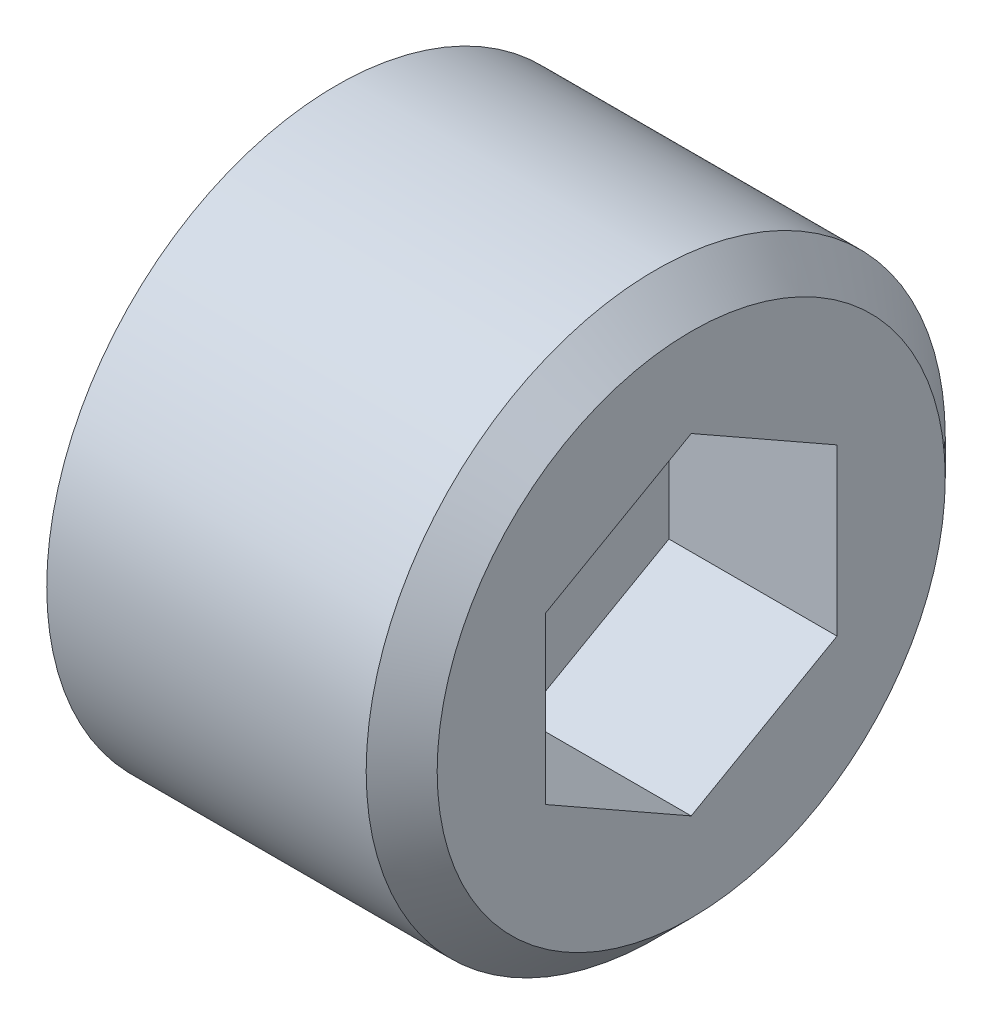
ISO-10303-21;
HEADER;
FILE_DESCRIPTION(('STEP AP214'),'2;1');
FILE_NAME('part.step','',(''),(''),'','','');
FILE_SCHEMA(('AUTOMOTIVE_DESIGN { 1 0 10303 214 1 1 1 1 }'));
ENDSEC;
DATA;
#1=APPLICATION_CONTEXT('core data for automotive mechanical design processes');
#2=APPLICATION_PROTOCOL_DEFINITION('international standard','automotive_design',2000,#1);
#3=PRODUCT_CONTEXT('',#1,'mechanical');
#4=PRODUCT('Part','Part','',(#3));
#5=PRODUCT_RELATED_PRODUCT_CATEGORY('part','',(#4));
#6=PRODUCT_DEFINITION_FORMATION('','',#4);
#7=PRODUCT_DEFINITION_CONTEXT('part definition',#1,'design');
#8=PRODUCT_DEFINITION('design','',#6,#7);
#9=PRODUCT_DEFINITION_SHAPE('','',#8);
#10=(LENGTH_UNIT() NAMED_UNIT(*) SI_UNIT(.MILLI.,.METRE.));
#11=(NAMED_UNIT(*) PLANE_ANGLE_UNIT() SI_UNIT($,.RADIAN.));
#12=(NAMED_UNIT(*) SI_UNIT($,.STERADIAN.) SOLID_ANGLE_UNIT());
#13=UNCERTAINTY_MEASURE_WITH_UNIT(LENGTH_MEASURE(1.E-05),#10,'distance_accuracy_value','');
#14=(GEOMETRIC_REPRESENTATION_CONTEXT(3) GLOBAL_UNCERTAINTY_ASSIGNED_CONTEXT((#13)) GLOBAL_UNIT_ASSIGNED_CONTEXT((#10,
#11,#12)) REPRESENTATION_CONTEXT('',''));
#15=CARTESIAN_POINT('',(0.,0.,0.));
#16=DIRECTION('',(0.,0.,1.));
#17=DIRECTION('',(1.,0.,0.));
#18=AXIS2_PLACEMENT_3D('',#15,#16,#17);
#19=CARTESIAN_POINT('',(698.265305948307,539.1641871,6.22299999999987));
#20=DIRECTION('',(1.,0.,0.));
#21=DIRECTION('',(0.,0.,-1.));
#22=AXIS2_PLACEMENT_3D('',#19,#20,#21);
#23=PLANE('',#22);
#24=DIRECTION('',(0.,0.493693899375207,0.869635747724128));
#25=VECTOR('',#24,1.);
#26=CARTESIAN_POINT('',(698.265305948307,540.289906050237,4.24005987808304));
#27=LINE('',#26,#25);
#28=CARTESIAN_POINT('',(698.265305948307,540.289906050237,4.24005987808304));
#29=VERTEX_POINT('',#28);
#30=CARTESIAN_POINT('',(698.265305948307,541.415625000473,6.22299999999981));
#31=VERTEX_POINT('',#30);
#32=EDGE_CURVE('E81',#29,#31,#27,.T.);
#33=ORIENTED_EDGE('',*,*,#32,.T.);
#34=DIRECTION('',(0.,-0.493693899375212,0.869635747724125));
#35=VECTOR('',#34,1.);
#36=CARTESIAN_POINT('',(698.265305948307,541.415625000473,6.22299999999987));
#37=LINE('',#36,#35);
#38=CARTESIAN_POINT('',(698.265305948307,540.289906050236,8.20594012191661));
#39=VERTEX_POINT('',#38);
#40=EDGE_CURVE('E65',#31,#39,#37,.T.);
#41=ORIENTED_EDGE('',*,*,#40,.T.);
#42=DIRECTION('',(0.,1.,0.));
#43=VECTOR('',#42,1.);
#44=CARTESIAN_POINT('',(698.265305948307,540.289906050237,8.20594012191668));
#45=LINE('',#44,#43);
#46=CARTESIAN_POINT('',(698.265305948307,538.038468149764,8.20594012191668));
#47=VERTEX_POINT('',#46);
#48=EDGE_CURVE('E70',#39,#47,#45,.F.);
#49=ORIENTED_EDGE('',*,*,#48,.T.);
#50=DIRECTION('',(0.,-0.493693899375212,-0.869635747724125));
#51=VECTOR('',#50,1.);
#52=CARTESIAN_POINT('',(698.265305948307,538.038468149764,8.20594012191668));
#53=LINE('',#52,#51);
#54=CARTESIAN_POINT('',(698.265305948307,536.912749199527,6.22299999999994));
#55=VERTEX_POINT('',#54);
#56=EDGE_CURVE('E104',#47,#55,#53,.T.);
#57=ORIENTED_EDGE('',*,*,#56,.T.);
#58=DIRECTION('',(0.,0.493693899375192,-0.869635747724136));
#59=VECTOR('',#58,1.);
#60=CARTESIAN_POINT('',(698.265305948307,536.912749199527,6.22299999999987));
#61=LINE('',#60,#59);
#62=CARTESIAN_POINT('',(698.265305948307,538.038468149764,4.2400598780831));
#63=VERTEX_POINT('',#62);
#64=EDGE_CURVE('E99',#55,#63,#61,.T.);
#65=ORIENTED_EDGE('',*,*,#64,.T.);
#66=DIRECTION('',(0.,1.,0.));
#67=VECTOR('',#66,1.);
#68=CARTESIAN_POINT('',(698.265305948307,538.038468149764,4.24005987808304));
#69=LINE('',#68,#67);
#70=EDGE_CURVE('E95',#63,#29,#69,.T.);
#71=ORIENTED_EDGE('',*,*,#70,.T.);
#72=EDGE_LOOP('',(#33,#41,#49,#57,#65,#71));
#73=FACE_BOUND('',#72,.T.);
#74=ADVANCED_FACE('F16',(#73),#23,.T.);
#75=CARTESIAN_POINT('',(700.551305948307,540.289906050237,8.20594012191668));
#76=DIRECTION('',(0.,0.,1.));
#77=DIRECTION('',(1.,0.,0.));
#78=AXIS2_PLACEMENT_3D('',#75,#76,#77);
#79=PLANE('',#78);
#80=DIRECTION('',(1.,0.,0.));
#81=VECTOR('',#80,1.);
#82=CARTESIAN_POINT('',(700.551305948307,540.289906050236,8.20594012191641));
#83=LINE('',#82,#81);
#84=CARTESIAN_POINT('',(700.551305948307,540.289906050236,8.20594012191661));
#85=VERTEX_POINT('',#84);
#86=EDGE_CURVE('E72',#39,#85,#83,.T.);
#87=ORIENTED_EDGE('',*,*,#86,.T.);
#88=DIRECTION('',(0.,1.,0.));
#89=VECTOR('',#88,1.);
#90=CARTESIAN_POINT('',(700.551305948307,539.1641871,8.20594012191668));
#91=LINE('',#90,#89);
#92=CARTESIAN_POINT('',(700.551305948307,538.038468149764,8.20594012191668));
#93=VERTEX_POINT('',#92);
#94=EDGE_CURVE('E106',#93,#85,#91,.T.);
#95=ORIENTED_EDGE('',*,*,#94,.F.);
#96=DIRECTION('',(1.,0.,0.));
#97=VECTOR('',#96,1.);
#98=CARTESIAN_POINT('',(700.551305948307,538.038468149764,8.20594012191668));
#99=LINE('',#98,#97);
#100=EDGE_CURVE('E75',#93,#47,#99,.F.);
#101=ORIENTED_EDGE('',*,*,#100,.T.);
#102=ORIENTED_EDGE('',*,*,#48,.F.);
#103=EDGE_LOOP('',(#87,#95,#101,#102));
#104=FACE_BOUND('',#103,.T.);
#105=ADVANCED_FACE('F71',(#104),#79,.F.);
#106=CARTESIAN_POINT('',(700.551305948307,541.415625000473,6.22299999999987));
#107=DIRECTION('',(0.,0.869635747724125,0.493693899375212));
#108=DIRECTION('',(0.,-0.493693899375212,0.869635747724125));
#109=AXIS2_PLACEMENT_3D('',#106,#107,#108);
#110=PLANE('',#109);
#111=DIRECTION('',(1.,0.,0.));
#112=VECTOR('',#111,1.);
#113=CARTESIAN_POINT('',(700.551305948307,541.415625000474,6.2229999999996));
#114=LINE('',#113,#112);
#115=CARTESIAN_POINT('',(700.551305948307,541.415625000473,6.22299999999981));
#116=VERTEX_POINT('',#115);
#117=EDGE_CURVE('E83',#31,#116,#114,.T.);
#118=ORIENTED_EDGE('',*,*,#117,.T.);
#119=DIRECTION('',(0.,0.49369389937501,-0.86963574772424));
#120=VECTOR('',#119,1.);
#121=CARTESIAN_POINT('',(700.551305948307,540.289906050237,8.20594012191668));
#122=LINE('',#121,#120);
#123=EDGE_CURVE('E87',#85,#116,#122,.T.);
#124=ORIENTED_EDGE('',*,*,#123,.F.);
#125=ORIENTED_EDGE('',*,*,#86,.F.);
#126=ORIENTED_EDGE('',*,*,#40,.F.);
#127=EDGE_LOOP('',(#118,#124,#125,#126));
#128=FACE_BOUND('',#127,.T.);
#129=ADVANCED_FACE('F85',(#128),#110,.F.);
#130=CARTESIAN_POINT('',(700.551305948307,540.289906050237,4.24005987808304));
#131=DIRECTION('',(0.,0.869635747724128,-0.493693899375207));
#132=DIRECTION('',(0.,0.493693899375207,0.869635747724128));
#133=AXIS2_PLACEMENT_3D('',#130,#131,#132);
#134=PLANE('',#133);
#135=DIRECTION('',(-1.,0.,0.));
#136=VECTOR('',#135,1.);
#137=CARTESIAN_POINT('',(700.551305948307,540.289906050237,4.24005987808304));
#138=LINE('',#137,#136);
#139=CARTESIAN_POINT('',(700.551305948307,540.289906050237,4.24005987808304));
#140=VERTEX_POINT('',#139);
#141=EDGE_CURVE('E93',#29,#140,#138,.F.);
#142=ORIENTED_EDGE('',*,*,#141,.T.);
#143=DIRECTION('',(0.,-0.493693899375005,-0.869635747724243));
#144=VECTOR('',#143,1.);
#145=CARTESIAN_POINT('',(700.551305948307,541.415625000473,6.22299999999987));
#146=LINE('',#145,#144);
#147=EDGE_CURVE('E109',#116,#140,#146,.T.);
#148=ORIENTED_EDGE('',*,*,#147,.F.);
#149=ORIENTED_EDGE('',*,*,#117,.F.);
#150=ORIENTED_EDGE('',*,*,#32,.F.);
#151=EDGE_LOOP('',(#142,#148,#149,#150));
#152=FACE_BOUND('',#151,.T.);
#153=ADVANCED_FACE('F191',(#152),#134,.F.);
#154=CARTESIAN_POINT('',(700.551305948307,538.038468149764,4.24005987808304));
#155=DIRECTION('',(0.,0.,-1.));
#156=DIRECTION('',(-1.,0.,0.));
#157=AXIS2_PLACEMENT_3D('',#154,#155,#156);
#158=PLANE('',#157);
#159=DIRECTION('',(1.,0.,0.));
#160=VECTOR('',#159,1.);
#161=CARTESIAN_POINT('',(700.551305948307,538.038468149764,4.24005987808328));
#162=LINE('',#161,#160);
#163=CARTESIAN_POINT('',(700.551305948307,538.038468149764,4.2400598780831));
#164=VERTEX_POINT('',#163);
#165=EDGE_CURVE('E97',#63,#164,#162,.T.);
#166=ORIENTED_EDGE('',*,*,#165,.T.);
#167=DIRECTION('',(0.,1.,0.));
#168=VECTOR('',#167,1.);
#169=CARTESIAN_POINT('',(700.551305948307,539.1641871,4.24005987808304));
#170=LINE('',#169,#168);
#171=EDGE_CURVE('E112',#140,#164,#170,.F.);
#172=ORIENTED_EDGE('',*,*,#171,.F.);
#173=ORIENTED_EDGE('',*,*,#141,.F.);
#174=ORIENTED_EDGE('',*,*,#70,.F.);
#175=EDGE_LOOP('',(#166,#172,#173,#174));
#176=FACE_BOUND('',#175,.T.);
#177=ADVANCED_FACE('F138',(#176),#158,.F.);
#178=CARTESIAN_POINT('',(700.551305948307,536.912749199527,6.22299999999987));
#179=DIRECTION('',(0.,-0.869635747724136,-0.493693899375192));
#180=DIRECTION('',(0.,0.493693899375192,-0.869635747724136));
#181=AXIS2_PLACEMENT_3D('',#178,#179,#180);
#182=PLANE('',#181);
#183=DIRECTION('',(1.,0.,0.));
#184=VECTOR('',#183,1.);
#185=CARTESIAN_POINT('',(700.551305948307,536.912749199527,6.22300000000014));
#186=LINE('',#185,#184);
#187=CARTESIAN_POINT('',(700.551305948307,536.912749199527,6.22299999999994));
#188=VERTEX_POINT('',#187);
#189=EDGE_CURVE('E33',#55,#188,#186,.T.);
#190=ORIENTED_EDGE('',*,*,#189,.T.);
#191=DIRECTION('',(0.,-0.493693899375005,0.869635747724243));
#192=VECTOR('',#191,1.);
#193=CARTESIAN_POINT('',(700.551305948307,538.038468149764,4.24005987808304));
#194=LINE('',#193,#192);
#195=EDGE_CURVE('E115',#164,#188,#194,.T.);
#196=ORIENTED_EDGE('',*,*,#195,.F.);
#197=ORIENTED_EDGE('',*,*,#165,.F.);
#198=ORIENTED_EDGE('',*,*,#64,.F.);
#199=EDGE_LOOP('',(#190,#196,#197,#198));
#200=FACE_BOUND('',#199,.T.);
#201=ADVANCED_FACE('F136',(#200),#182,.F.);
#202=CARTESIAN_POINT('',(700.551305948307,538.038468149764,8.20594012191668));
#203=DIRECTION('',(0.,-0.869635747724125,0.493693899375212));
#204=DIRECTION('',(0.,-0.493693899375212,-0.869635747724125));
#205=AXIS2_PLACEMENT_3D('',#202,#203,#204);
#206=PLANE('',#205);
#207=ORIENTED_EDGE('',*,*,#100,.F.);
#208=DIRECTION('',(0.,0.49369389937501,0.86963574772424));
#209=VECTOR('',#208,1.);
#210=CARTESIAN_POINT('',(700.551305948307,536.912749199527,6.22299999999987));
#211=LINE('',#210,#209);
#212=EDGE_CURVE('E118',#188,#93,#211,.T.);
#213=ORIENTED_EDGE('',*,*,#212,.F.);
#214=ORIENTED_EDGE('',*,*,#189,.F.);
#215=ORIENTED_EDGE('',*,*,#56,.F.);
#216=EDGE_LOOP('',(#207,#213,#214,#215));
#217=FACE_BOUND('',#216,.T.);
#218=ADVANCED_FACE('F132',(#217),#206,.F.);
#219=CARTESIAN_POINT('',(700.551305948307,539.1641871,6.22299999999987));
#220=DIRECTION('',(1.,0.,0.));
#221=DIRECTION('',(0.,0.,-1.));
#222=AXIS2_PLACEMENT_3D('',#219,#220,#221);
#223=PLANE('',#222);
#224=CARTESIAN_POINT('',(700.551305948295,539.1641871,6.22299999999987));
#225=DIRECTION('',(-1.,0.,0.));
#226=DIRECTION('',(0.,0.,1.));
#227=AXIS2_PLACEMENT_3D('',#224,#225,#226);
#228=CIRCLE('',#227,3.45439999998221);
#229=CARTESIAN_POINT('',(700.551305948295,539.1641871,9.67739999998208));
#230=VERTEX_POINT('',#229);
#231=EDGE_CURVE('E19',#230,#230,#228,.T.);
#232=ORIENTED_EDGE('',*,*,#231,.F.);
#233=EDGE_LOOP('',(#232));
#234=FACE_BOUND('',#233,.T.);
#235=ORIENTED_EDGE('',*,*,#195,.T.);
#236=ORIENTED_EDGE('',*,*,#212,.T.);
#237=ORIENTED_EDGE('',*,*,#94,.T.);
#238=ORIENTED_EDGE('',*,*,#123,.T.);
#239=ORIENTED_EDGE('',*,*,#147,.T.);
#240=ORIENTED_EDGE('',*,*,#171,.T.);
#241=EDGE_LOOP('',(#235,#236,#237,#238,#239,#240));
#242=FACE_BOUND('',#241,.T.);
#243=ADVANCED_FACE('F129',(#234,#242),#223,.T.);
#244=CARTESIAN_POINT('',(700.068705948411,539.1641871,6.22299999999987));
#245=DIRECTION('',(-1.,0.,0.));
#246=DIRECTION('',(0.,0.,1.));
#247=AXIS2_PLACEMENT_3D('',#244,#245,#246);
#248=CONICAL_SURFACE('',#247,3.93699999986652,0.785398163397448);
#249=CARTESIAN_POINT('',(700.068705948307,539.1641871,6.22299999999987));
#250=DIRECTION('',(1.,0.,0.));
#251=DIRECTION('',(0.,0.,-1.));
#252=AXIS2_PLACEMENT_3D('',#249,#250,#251);
#253=CIRCLE('',#252,3.937);
#254=CARTESIAN_POINT('',(700.068705948307,539.1641871,2.28599999999987));
#255=VERTEX_POINT('',#254);
#256=EDGE_CURVE('E25',#255,#255,#253,.F.);
#257=ORIENTED_EDGE('',*,*,#256,.F.);
#258=EDGE_LOOP('',(#257));
#259=FACE_BOUND('',#258,.T.);
#260=ORIENTED_EDGE('',*,*,#231,.T.);
#261=EDGE_LOOP('',(#260));
#262=FACE_BOUND('',#261,.T.);
#263=ADVANCED_FACE('F127',(#259,#262),#248,.T.);
#264=CARTESIAN_POINT('',(695.725305948307,539.1641871,6.22299999999987));
#265=DIRECTION('',(1.,0.,0.));
#266=DIRECTION('',(0.,0.,-1.));
#267=AXIS2_PLACEMENT_3D('',#264,#265,#266);
#268=PLANE('',#267);
#269=CARTESIAN_POINT('',(695.725305948307,539.1641871,6.22299999999987));
#270=DIRECTION('',(1.,0.,0.));
#271=DIRECTION('',(0.,0.,-1.));
#272=AXIS2_PLACEMENT_3D('',#269,#270,#271);
#273=CIRCLE('',#272,3.937);
#274=CARTESIAN_POINT('',(695.725305948307,539.1641871,2.28599999999987));
#275=VERTEX_POINT('',#274);
#276=EDGE_CURVE('E11',#275,#275,#273,.T.);
#277=ORIENTED_EDGE('',*,*,#276,.F.);
#278=EDGE_LOOP('',(#277));
#279=FACE_BOUND('',#278,.T.);
#280=ADVANCED_FACE('F150',(#279),#268,.F.);
#281=CARTESIAN_POINT('',(700.551305948307,539.1641871,6.22299999999987));
#282=DIRECTION('',(1.,0.,0.));
#283=DIRECTION('',(0.,0.,-1.));
#284=AXIS2_PLACEMENT_3D('',#281,#282,#283);
#285=CYLINDRICAL_SURFACE('',#284,3.937);
#286=ORIENTED_EDGE('',*,*,#256,.T.);
#287=EDGE_LOOP('',(#286));
#288=FACE_BOUND('',#287,.T.);
#289=ORIENTED_EDGE('',*,*,#276,.T.);
#290=EDGE_LOOP('',(#289));
#291=FACE_BOUND('',#290,.T.);
#292=ADVANCED_FACE('F148',(#288,#291),#285,.T.);
#293=CLOSED_SHELL('',(#74,#105,#129,#153,#177,#201,#218,#243,#263,#280,#292));
#294=MANIFOLD_SOLID_BREP('B1',#293);
#295=ADVANCED_BREP_SHAPE_REPRESENTATION('',(#18,#294),#14);
#296=SHAPE_DEFINITION_REPRESENTATION(#9,#295);
ENDSEC;
END-ISO-10303-21;
